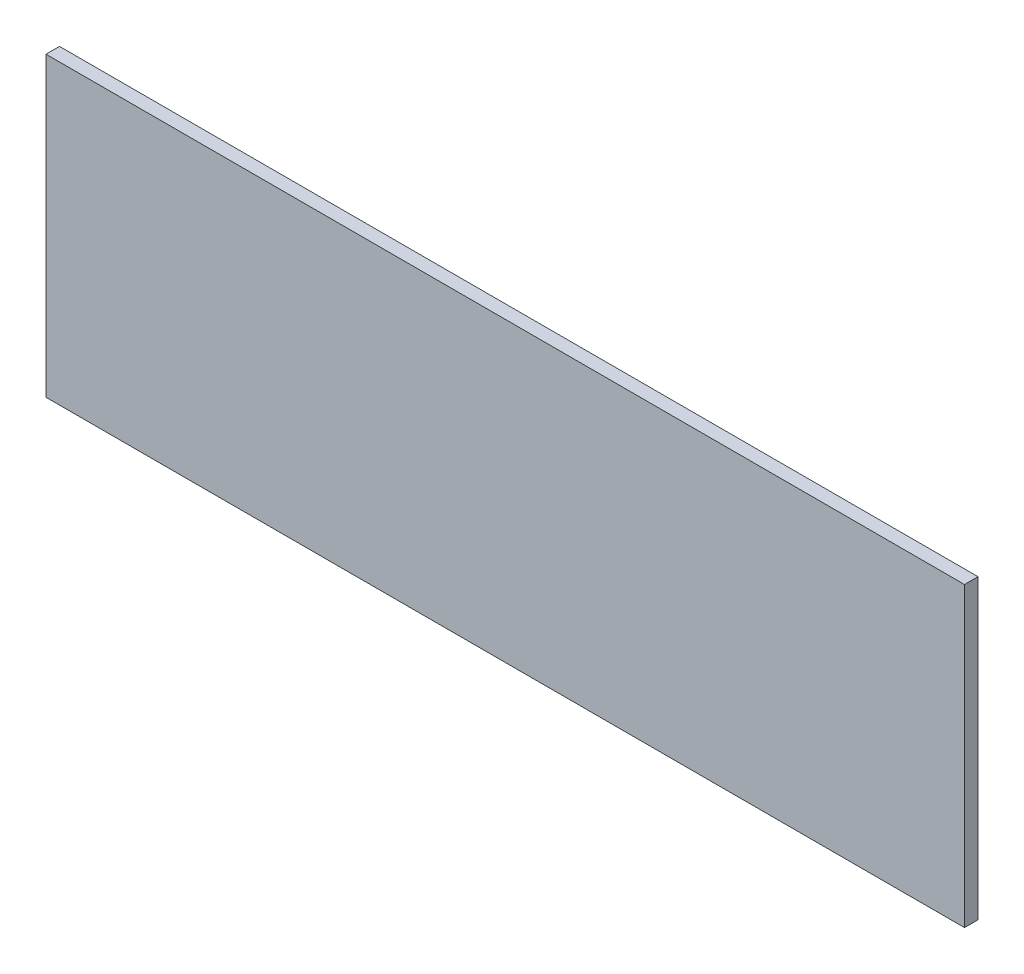
ISO-10303-21;
HEADER;
FILE_DESCRIPTION(('STEP AP214'),'2;1');
FILE_NAME('part.step','',(''),(''),'','','');
FILE_SCHEMA(('AUTOMOTIVE_DESIGN { 1 0 10303 214 1 1 1 1 }'));
ENDSEC;
DATA;
#1=APPLICATION_CONTEXT('core data for automotive mechanical design processes');
#2=APPLICATION_PROTOCOL_DEFINITION('international standard','automotive_design',2000,#1);
#3=PRODUCT_CONTEXT('',#1,'mechanical');
#4=PRODUCT('Part','Part','',(#3));
#5=PRODUCT_RELATED_PRODUCT_CATEGORY('part','',(#4));
#6=PRODUCT_DEFINITION_FORMATION('','',#4);
#7=PRODUCT_DEFINITION_CONTEXT('part definition',#1,'design');
#8=PRODUCT_DEFINITION('design','',#6,#7);
#9=PRODUCT_DEFINITION_SHAPE('','',#8);
#10=(LENGTH_UNIT() NAMED_UNIT(*) SI_UNIT(.MILLI.,.METRE.));
#11=(NAMED_UNIT(*) PLANE_ANGLE_UNIT() SI_UNIT($,.RADIAN.));
#12=(NAMED_UNIT(*) SI_UNIT($,.STERADIAN.) SOLID_ANGLE_UNIT());
#13=UNCERTAINTY_MEASURE_WITH_UNIT(LENGTH_MEASURE(1.E-05),#10,'distance_accuracy_value','');
#14=(GEOMETRIC_REPRESENTATION_CONTEXT(3) GLOBAL_UNCERTAINTY_ASSIGNED_CONTEXT((#13)) GLOBAL_UNIT_ASSIGNED_CONTEXT((#10,
#11,#12)) REPRESENTATION_CONTEXT('',''));
#15=CARTESIAN_POINT('',(0.,0.,0.));
#16=DIRECTION('',(0.,0.,1.));
#17=DIRECTION('',(1.,0.,0.));
#18=AXIS2_PLACEMENT_3D('',#15,#16,#17);
#19=CARTESIAN_POINT('',(0.,0.,6.35));
#20=DIRECTION('',(1.,0.,0.));
#21=DIRECTION('',(0.,0.,-1.));
#22=AXIS2_PLACEMENT_3D('',#19,#20,#21);
#23=PLANE('',#22);
#24=DIRECTION('',(0.,-1.,0.));
#25=VECTOR('',#24,1.);
#26=CARTESIAN_POINT('',(0.,0.,0.));
#27=LINE('',#26,#25);
#28=CARTESIAN_POINT('',(0.,139.7,0.));
#29=VERTEX_POINT('',#28);
#30=CARTESIAN_POINT('',(0.,0.,0.));
#31=VERTEX_POINT('',#30);
#32=EDGE_CURVE('E96',#29,#31,#27,.T.);
#33=ORIENTED_EDGE('',*,*,#32,.T.);
#34=DIRECTION('',(0.,0.,-1.));
#35=VECTOR('',#34,1.);
#36=CARTESIAN_POINT('',(0.,0.,6.35));
#37=LINE('',#36,#35);
#38=CARTESIAN_POINT('',(0.,0.,6.35));
#39=VERTEX_POINT('',#38);
#40=EDGE_CURVE('E11',#39,#31,#37,.T.);
#41=ORIENTED_EDGE('',*,*,#40,.F.);
#42=DIRECTION('',(0.,-1.,0.));
#43=VECTOR('',#42,1.);
#44=CARTESIAN_POINT('',(0.,0.,6.35));
#45=LINE('',#44,#43);
#46=CARTESIAN_POINT('',(0.,139.7,6.35));
#47=VERTEX_POINT('',#46);
#48=EDGE_CURVE('E84',#47,#39,#45,.T.);
#49=ORIENTED_EDGE('',*,*,#48,.F.);
#50=DIRECTION('',(0.,0.,-1.));
#51=VECTOR('',#50,1.);
#52=CARTESIAN_POINT('',(0.,139.7,6.35));
#53=LINE('',#52,#51);
#54=EDGE_CURVE('E92',#47,#29,#53,.T.);
#55=ORIENTED_EDGE('',*,*,#54,.T.);
#56=EDGE_LOOP('',(#33,#41,#49,#55));
#57=FACE_BOUND('',#56,.T.);
#58=ADVANCED_FACE('F33',(#57),#23,.F.);
#59=CARTESIAN_POINT('',(0.,0.,6.35));
#60=DIRECTION('',(0.,1.,0.));
#61=DIRECTION('',(0.,0.,1.));
#62=AXIS2_PLACEMENT_3D('',#59,#60,#61);
#63=PLANE('',#62);
#64=DIRECTION('',(1.,0.,0.));
#65=VECTOR('',#64,1.);
#66=CARTESIAN_POINT('',(0.,0.,0.));
#67=LINE('',#66,#65);
#68=CARTESIAN_POINT('',(431.8,0.,0.));
#69=VERTEX_POINT('',#68);
#70=EDGE_CURVE('E88',#31,#69,#67,.T.);
#71=ORIENTED_EDGE('',*,*,#70,.T.);
#72=DIRECTION('',(0.,0.,-1.));
#73=VECTOR('',#72,1.);
#74=CARTESIAN_POINT('',(431.8,0.,6.35));
#75=LINE('',#74,#73);
#76=CARTESIAN_POINT('',(431.8,0.,6.35));
#77=VERTEX_POINT('',#76);
#78=EDGE_CURVE('E41',#77,#69,#75,.T.);
#79=ORIENTED_EDGE('',*,*,#78,.F.);
#80=DIRECTION('',(1.,0.,0.));
#81=VECTOR('',#80,1.);
#82=CARTESIAN_POINT('',(0.,0.,6.35));
#83=LINE('',#82,#81);
#84=EDGE_CURVE('E79',#39,#77,#83,.T.);
#85=ORIENTED_EDGE('',*,*,#84,.F.);
#86=ORIENTED_EDGE('',*,*,#40,.T.);
#87=EDGE_LOOP('',(#71,#79,#85,#86));
#88=FACE_BOUND('',#87,.T.);
#89=ADVANCED_FACE('F87',(#88),#63,.F.);
#90=CARTESIAN_POINT('',(431.8,0.,6.35));
#91=DIRECTION('',(-1.,0.,0.));
#92=DIRECTION('',(0.,0.,1.));
#93=AXIS2_PLACEMENT_3D('',#90,#91,#92);
#94=PLANE('',#93);
#95=DIRECTION('',(0.,1.,0.));
#96=VECTOR('',#95,1.);
#97=CARTESIAN_POINT('',(431.8,0.,0.));
#98=LINE('',#97,#96);
#99=CARTESIAN_POINT('',(431.8,139.7,0.));
#100=VERTEX_POINT('',#99);
#101=EDGE_CURVE('E66',#69,#100,#98,.T.);
#102=ORIENTED_EDGE('',*,*,#101,.T.);
#103=DIRECTION('',(0.,0.,-1.));
#104=VECTOR('',#103,1.);
#105=CARTESIAN_POINT('',(431.8,139.7,6.35));
#106=LINE('',#105,#104);
#107=CARTESIAN_POINT('',(431.8,139.7,6.35));
#108=VERTEX_POINT('',#107);
#109=EDGE_CURVE('E89',#108,#100,#106,.T.);
#110=ORIENTED_EDGE('',*,*,#109,.F.);
#111=DIRECTION('',(0.,1.,0.));
#112=VECTOR('',#111,1.);
#113=CARTESIAN_POINT('',(431.8,0.,6.35));
#114=LINE('',#113,#112);
#115=EDGE_CURVE('E82',#77,#108,#114,.T.);
#116=ORIENTED_EDGE('',*,*,#115,.F.);
#117=ORIENTED_EDGE('',*,*,#78,.T.);
#118=EDGE_LOOP('',(#102,#110,#116,#117));
#119=FACE_BOUND('',#118,.T.);
#120=ADVANCED_FACE('F90',(#119),#94,.F.);
#121=CARTESIAN_POINT('',(0.,139.7,6.35));
#122=DIRECTION('',(0.,-1.,0.));
#123=DIRECTION('',(0.,0.,-1.));
#124=AXIS2_PLACEMENT_3D('',#121,#122,#123);
#125=PLANE('',#124);
#126=DIRECTION('',(-1.,0.,0.));
#127=VECTOR('',#126,1.);
#128=CARTESIAN_POINT('',(0.,139.7,0.));
#129=LINE('',#128,#127);
#130=EDGE_CURVE('E72',#100,#29,#129,.T.);
#131=ORIENTED_EDGE('',*,*,#130,.T.);
#132=ORIENTED_EDGE('',*,*,#54,.F.);
#133=DIRECTION('',(-1.,0.,0.));
#134=VECTOR('',#133,1.);
#135=CARTESIAN_POINT('',(0.,139.7,6.35));
#136=LINE('',#135,#134);
#137=EDGE_CURVE('E49',#108,#47,#136,.T.);
#138=ORIENTED_EDGE('',*,*,#137,.F.);
#139=ORIENTED_EDGE('',*,*,#109,.T.);
#140=EDGE_LOOP('',(#131,#132,#138,#139));
#141=FACE_BOUND('',#140,.T.);
#142=ADVANCED_FACE('F103',(#141),#125,.F.);
#143=CARTESIAN_POINT('',(0.,0.,6.35));
#144=DIRECTION('',(0.,0.,-1.));
#145=DIRECTION('',(-1.,0.,0.));
#146=AXIS2_PLACEMENT_3D('',#143,#144,#145);
#147=PLANE('',#146);
#148=ORIENTED_EDGE('',*,*,#48,.T.);
#149=ORIENTED_EDGE('',*,*,#84,.T.);
#150=ORIENTED_EDGE('',*,*,#115,.T.);
#151=ORIENTED_EDGE('',*,*,#137,.T.);
#152=EDGE_LOOP('',(#148,#149,#150,#151));
#153=FACE_BOUND('',#152,.T.);
#154=ADVANCED_FACE('F80',(#153),#147,.F.);
#155=CARTESIAN_POINT('',(0.,0.,0.));
#156=DIRECTION('',(0.,0.,-1.));
#157=DIRECTION('',(-1.,0.,0.));
#158=AXIS2_PLACEMENT_3D('',#155,#156,#157);
#159=PLANE('',#158);
#160=ORIENTED_EDGE('',*,*,#32,.F.);
#161=ORIENTED_EDGE('',*,*,#130,.F.);
#162=ORIENTED_EDGE('',*,*,#101,.F.);
#163=ORIENTED_EDGE('',*,*,#70,.F.);
#164=EDGE_LOOP('',(#160,#161,#162,#163));
#165=FACE_BOUND('',#164,.T.);
#166=ADVANCED_FACE('F106',(#165),#159,.T.);
#167=CLOSED_SHELL('',(#58,#89,#120,#142,#154,#166));
#168=MANIFOLD_SOLID_BREP('B2',#167);
#169=ADVANCED_BREP_SHAPE_REPRESENTATION('',(#18,#168),#14);
#170=SHAPE_DEFINITION_REPRESENTATION(#9,#169);
ENDSEC;
END-ISO-10303-21;
